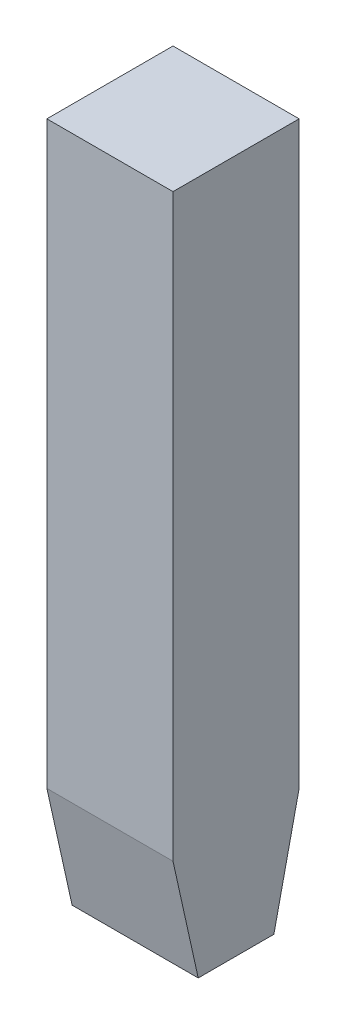
ISO-10303-21;
HEADER;
FILE_DESCRIPTION(('STEP AP214'),'2;1');
FILE_NAME('part.step','',(''),(''),'','','');
FILE_SCHEMA(('AUTOMOTIVE_DESIGN { 1 0 10303 214 1 1 1 1 }'));
ENDSEC;
DATA;
#1=APPLICATION_CONTEXT('core data for automotive mechanical design processes');
#2=APPLICATION_PROTOCOL_DEFINITION('international standard','automotive_design',2000,#1);
#3=PRODUCT_CONTEXT('',#1,'mechanical');
#4=PRODUCT('Part','Part','',(#3));
#5=PRODUCT_RELATED_PRODUCT_CATEGORY('part','',(#4));
#6=PRODUCT_DEFINITION_FORMATION('','',#4);
#7=PRODUCT_DEFINITION_CONTEXT('part definition',#1,'design');
#8=PRODUCT_DEFINITION('design','',#6,#7);
#9=PRODUCT_DEFINITION_SHAPE('','',#8);
#10=(LENGTH_UNIT() NAMED_UNIT(*) SI_UNIT(.MILLI.,.METRE.));
#11=(NAMED_UNIT(*) PLANE_ANGLE_UNIT() SI_UNIT($,.RADIAN.));
#12=(NAMED_UNIT(*) SI_UNIT($,.STERADIAN.) SOLID_ANGLE_UNIT());
#13=UNCERTAINTY_MEASURE_WITH_UNIT(LENGTH_MEASURE(1.E-05),#10,'distance_accuracy_value','');
#14=(GEOMETRIC_REPRESENTATION_CONTEXT(3) GLOBAL_UNCERTAINTY_ASSIGNED_CONTEXT((#13)) GLOBAL_UNIT_ASSIGNED_CONTEXT((#10,
#11,#12)) REPRESENTATION_CONTEXT('',''));
#15=CARTESIAN_POINT('',(0.,0.,0.));
#16=DIRECTION('',(0.,0.,1.));
#17=DIRECTION('',(1.,0.,0.));
#18=AXIS2_PLACEMENT_3D('',#15,#16,#17);
#19=CARTESIAN_POINT('',(5.,-27.5,4.99999999999989));
#20=DIRECTION('',(0.,1.,0.));
#21=DIRECTION('',(0.,0.,1.));
#22=AXIS2_PLACEMENT_3D('',#19,#20,#21);
#23=PLANE('',#22);
#24=DIRECTION('',(0.,0.,-1.));
#25=VECTOR('',#24,1.);
#26=CARTESIAN_POINT('',(-5.,-27.5,4.99999999999995));
#27=LINE('',#26,#25);
#28=CARTESIAN_POINT('',(-5.,-27.4999999999999,3.00000000000006));
#29=VERTEX_POINT('',#28);
#30=CARTESIAN_POINT('',(-5.,-27.5,-3.));
#31=VERTEX_POINT('',#30);
#32=EDGE_CURVE('E132',#29,#31,#27,.T.);
#33=ORIENTED_EDGE('',*,*,#32,.T.);
#34=DIRECTION('',(1.,0.,0.));
#35=VECTOR('',#34,1.);
#36=CARTESIAN_POINT('',(-5.,-27.5,-3.));
#37=LINE('',#36,#35);
#38=CARTESIAN_POINT('',(5.,-27.5,-3.));
#39=VERTEX_POINT('',#38);
#40=EDGE_CURVE('E66',#31,#39,#37,.T.);
#41=ORIENTED_EDGE('',*,*,#40,.T.);
#42=DIRECTION('',(0.,0.,-1.));
#43=VECTOR('',#42,1.);
#44=CARTESIAN_POINT('',(5.,-27.5,4.99999999999989));
#45=LINE('',#44,#43);
#46=CARTESIAN_POINT('',(5.,-27.5,3.));
#47=VERTEX_POINT('',#46);
#48=EDGE_CURVE('E118',#47,#39,#45,.T.);
#49=ORIENTED_EDGE('',*,*,#48,.F.);
#50=DIRECTION('',(1.,0.,0.));
#51=VECTOR('',#50,1.);
#52=CARTESIAN_POINT('',(-5.,-27.4999999999999,3.00000000000006));
#53=LINE('',#52,#51);
#54=EDGE_CURVE('E153',#29,#47,#53,.T.);
#55=ORIENTED_EDGE('',*,*,#54,.F.);
#56=EDGE_LOOP('',(#33,#41,#49,#55));
#57=FACE_BOUND('',#56,.T.);
#58=ADVANCED_FACE('F52',(#57),#23,.F.);
#59=CARTESIAN_POINT('',(5.,-27.4999999999999,-4.99999999999989));
#60=DIRECTION('',(0.,0.,1.));
#61=DIRECTION('',(1.,0.,0.));
#62=AXIS2_PLACEMENT_3D('',#59,#60,#61);
#63=PLANE('',#62);
#64=DIRECTION('',(0.,1.,0.));
#65=VECTOR('',#64,1.);
#66=CARTESIAN_POINT('',(5.,-27.4999999999999,-4.99999999999989));
#67=LINE('',#66,#65);
#68=CARTESIAN_POINT('',(4.99999999999999,-18.4785829926758,-4.99999999999995));
#69=VERTEX_POINT('',#68);
#70=CARTESIAN_POINT('',(5.,27.5,-4.99999999999989));
#71=VERTEX_POINT('',#70);
#72=EDGE_CURVE('E114',#69,#71,#67,.T.);
#73=ORIENTED_EDGE('',*,*,#72,.F.);
#74=DIRECTION('',(1.,0.,0.));
#75=VECTOR('',#74,1.);
#76=CARTESIAN_POINT('',(-5.00000000000001,-18.4785829926758,-5.));
#77=LINE('',#76,#75);
#78=CARTESIAN_POINT('',(-5.00000000000001,-18.4785829926758,-5.));
#79=VERTEX_POINT('',#78);
#80=EDGE_CURVE('E102',#79,#69,#77,.T.);
#81=ORIENTED_EDGE('',*,*,#80,.F.);
#82=DIRECTION('',(0.,1.,0.));
#83=VECTOR('',#82,1.);
#84=CARTESIAN_POINT('',(-5.00000000000001,-27.4999999999999,-4.99999999999989));
#85=LINE('',#84,#83);
#86=CARTESIAN_POINT('',(-5.00000000000001,27.5000000000001,-4.99999999999989));
#87=VERTEX_POINT('',#86);
#88=EDGE_CURVE('E135',#79,#87,#85,.T.);
#89=ORIENTED_EDGE('',*,*,#88,.T.);
#90=DIRECTION('',(-1.,0.,0.));
#91=VECTOR('',#90,1.);
#92=CARTESIAN_POINT('',(5.,27.5,-4.99999999999989));
#93=LINE('',#92,#91);
#94=EDGE_CURVE('E12',#71,#87,#93,.T.);
#95=ORIENTED_EDGE('',*,*,#94,.F.);
#96=EDGE_LOOP('',(#73,#81,#89,#95));
#97=FACE_BOUND('',#96,.T.);
#98=ADVANCED_FACE('F120',(#97),#63,.F.);
#99=CARTESIAN_POINT('',(4.99999999999999,27.5000000000001,5.));
#100=DIRECTION('',(0.,-1.,0.));
#101=DIRECTION('',(0.,0.,-1.));
#102=AXIS2_PLACEMENT_3D('',#99,#100,#101);
#103=PLANE('',#102);
#104=DIRECTION('',(0.,0.,1.));
#105=VECTOR('',#104,1.);
#106=CARTESIAN_POINT('',(-5.,27.5,5.));
#107=LINE('',#106,#105);
#108=CARTESIAN_POINT('',(-5.,27.5,5.));
#109=VERTEX_POINT('',#108);
#110=EDGE_CURVE('E137',#87,#109,#107,.T.);
#111=ORIENTED_EDGE('',*,*,#110,.T.);
#112=DIRECTION('',(-1.,0.,0.));
#113=VECTOR('',#112,1.);
#114=CARTESIAN_POINT('',(4.99999999999999,27.5000000000001,5.));
#115=LINE('',#114,#113);
#116=CARTESIAN_POINT('',(4.99999999999999,27.5000000000001,5.));
#117=VERTEX_POINT('',#116);
#118=EDGE_CURVE('E59',#117,#109,#115,.T.);
#119=ORIENTED_EDGE('',*,*,#118,.F.);
#120=DIRECTION('',(0.,0.,1.));
#121=VECTOR('',#120,1.);
#122=CARTESIAN_POINT('',(4.99999999999999,27.5000000000001,5.));
#123=LINE('',#122,#121);
#124=EDGE_CURVE('E122',#71,#117,#123,.T.);
#125=ORIENTED_EDGE('',*,*,#124,.F.);
#126=ORIENTED_EDGE('',*,*,#94,.T.);
#127=EDGE_LOOP('',(#111,#119,#125,#126));
#128=FACE_BOUND('',#127,.T.);
#129=ADVANCED_FACE('F158',(#128),#103,.F.);
#130=CARTESIAN_POINT('',(5.,-27.5,4.99999999999989));
#131=DIRECTION('',(0.,0.,-1.));
#132=DIRECTION('',(-1.,0.,0.));
#133=AXIS2_PLACEMENT_3D('',#130,#131,#132);
#134=PLANE('',#133);
#135=DIRECTION('',(0.,-1.,0.));
#136=VECTOR('',#135,1.);
#137=CARTESIAN_POINT('',(-5.,-27.5,4.99999999999995));
#138=LINE('',#137,#136);
#139=CARTESIAN_POINT('',(-4.99999999999999,-18.4785829926757,5.));
#140=VERTEX_POINT('',#139);
#141=EDGE_CURVE('E126',#109,#140,#138,.T.);
#142=ORIENTED_EDGE('',*,*,#141,.T.);
#143=DIRECTION('',(1.,0.,0.));
#144=VECTOR('',#143,1.);
#145=CARTESIAN_POINT('',(-4.99999999999999,-18.4785829926757,5.00000000000006));
#146=LINE('',#145,#144);
#147=CARTESIAN_POINT('',(4.99999999999999,-18.4785829926758,5.));
#148=VERTEX_POINT('',#147);
#149=EDGE_CURVE('E74',#140,#148,#146,.T.);
#150=ORIENTED_EDGE('',*,*,#149,.T.);
#151=DIRECTION('',(0.,-1.,0.));
#152=VECTOR('',#151,1.);
#153=CARTESIAN_POINT('',(5.,-27.5,4.99999999999989));
#154=LINE('',#153,#152);
#155=EDGE_CURVE('E124',#117,#148,#154,.T.);
#156=ORIENTED_EDGE('',*,*,#155,.F.);
#157=ORIENTED_EDGE('',*,*,#118,.T.);
#158=EDGE_LOOP('',(#142,#150,#156,#157));
#159=FACE_BOUND('',#158,.T.);
#160=ADVANCED_FACE('F145',(#159),#134,.F.);
#161=CARTESIAN_POINT('',(5.,-27.4999999999999,-4.99999999999989));
#162=DIRECTION('',(1.,0.,0.));
#163=DIRECTION('',(0.,0.,-1.));
#164=AXIS2_PLACEMENT_3D('',#161,#162,#163);
#165=PLANE('',#164);
#166=DIRECTION('',(0.,-0.976296007119934,0.2164396139381));
#167=VECTOR('',#166,1.);
#168=CARTESIAN_POINT('',(4.99999999999999,-18.4785829926758,-4.99999999999995));
#169=LINE('',#168,#167);
#170=EDGE_CURVE('E105',#69,#39,#169,.T.);
#171=ORIENTED_EDGE('',*,*,#170,.F.);
#172=ORIENTED_EDGE('',*,*,#72,.T.);
#173=ORIENTED_EDGE('',*,*,#124,.T.);
#174=ORIENTED_EDGE('',*,*,#155,.T.);
#175=DIRECTION('',(0.,0.976296007119934,0.2164396139381));
#176=VECTOR('',#175,1.);
#177=CARTESIAN_POINT('',(5.,-27.5,3.));
#178=LINE('',#177,#176);
#179=EDGE_CURVE('E154',#47,#148,#178,.T.);
#180=ORIENTED_EDGE('',*,*,#179,.F.);
#181=ORIENTED_EDGE('',*,*,#48,.T.);
#182=EDGE_LOOP('',(#171,#172,#173,#174,#180,#181));
#183=FACE_BOUND('',#182,.T.);
#184=ADVANCED_FACE('F113',(#183),#165,.T.);
#185=CARTESIAN_POINT('',(-5.00000000000001,-27.4999999999999,-4.99999999999989));
#186=DIRECTION('',(1.,0.,0.));
#187=DIRECTION('',(0.,0.,-1.));
#188=AXIS2_PLACEMENT_3D('',#185,#186,#187);
#189=PLANE('',#188);
#190=ORIENTED_EDGE('',*,*,#88,.F.);
#191=DIRECTION('',(0.,-0.976296007119934,0.2164396139381));
#192=VECTOR('',#191,1.);
#193=CARTESIAN_POINT('',(-5.00000000000001,-18.4785829926758,-5.));
#194=LINE('',#193,#192);
#195=EDGE_CURVE('E106',#79,#31,#194,.T.);
#196=ORIENTED_EDGE('',*,*,#195,.T.);
#197=ORIENTED_EDGE('',*,*,#32,.F.);
#198=DIRECTION('',(0.,0.976296007119934,0.2164396139381));
#199=VECTOR('',#198,1.);
#200=CARTESIAN_POINT('',(-5.,-27.4999999999999,3.00000000000006));
#201=LINE('',#200,#199);
#202=EDGE_CURVE('E151',#29,#140,#201,.T.);
#203=ORIENTED_EDGE('',*,*,#202,.T.);
#204=ORIENTED_EDGE('',*,*,#141,.F.);
#205=ORIENTED_EDGE('',*,*,#110,.F.);
#206=EDGE_LOOP('',(#190,#196,#197,#203,#204,#205));
#207=FACE_BOUND('',#206,.T.);
#208=ADVANCED_FACE('F149',(#207),#189,.F.);
#209=CARTESIAN_POINT('',(-5.,-27.4999999999999,3.00000000000006));
#210=DIRECTION('',(0.,0.2164396139381,-0.976296007119934));
#211=DIRECTION('',(0.,0.976296007119934,0.2164396139381));
#212=AXIS2_PLACEMENT_3D('',#209,#210,#211);
#213=PLANE('',#212);
#214=ORIENTED_EDGE('',*,*,#149,.F.);
#215=ORIENTED_EDGE('',*,*,#202,.F.);
#216=ORIENTED_EDGE('',*,*,#54,.T.);
#217=ORIENTED_EDGE('',*,*,#179,.T.);
#218=EDGE_LOOP('',(#214,#215,#216,#217));
#219=FACE_BOUND('',#218,.T.);
#220=ADVANCED_FACE('F170',(#219),#213,.F.);
#221=CARTESIAN_POINT('',(-5.00000000000001,-18.4785829926758,-5.));
#222=DIRECTION('',(0.,0.2164396139381,0.976296007119934));
#223=DIRECTION('',(0.,-0.976296007119934,0.2164396139381));
#224=AXIS2_PLACEMENT_3D('',#221,#222,#223);
#225=PLANE('',#224);
#226=ORIENTED_EDGE('',*,*,#40,.F.);
#227=ORIENTED_EDGE('',*,*,#195,.F.);
#228=ORIENTED_EDGE('',*,*,#80,.T.);
#229=ORIENTED_EDGE('',*,*,#170,.T.);
#230=EDGE_LOOP('',(#226,#227,#228,#229));
#231=FACE_BOUND('',#230,.T.);
#232=ADVANCED_FACE('F104',(#231),#225,.F.);
#233=CLOSED_SHELL('',(#58,#98,#129,#160,#184,#208,#220,#232));
#234=MANIFOLD_SOLID_BREP('B2',#233);
#235=ADVANCED_BREP_SHAPE_REPRESENTATION('',(#18,#234),#14);
#236=SHAPE_DEFINITION_REPRESENTATION(#9,#235);
ENDSEC;
END-ISO-10303-21;
